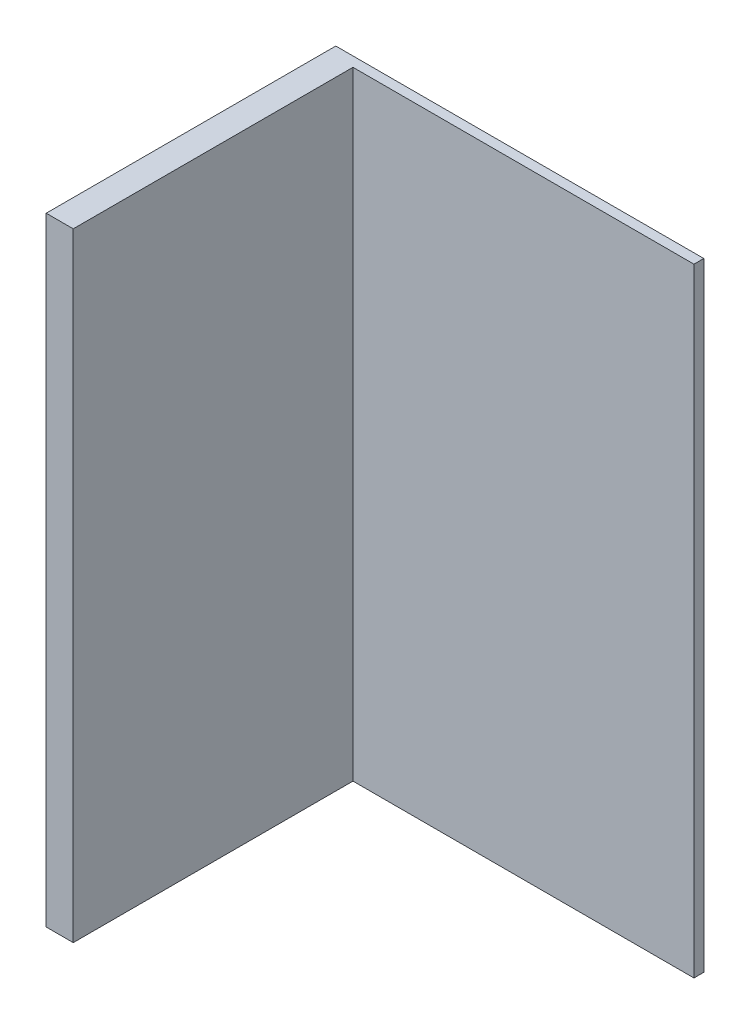
ISO-10303-21;
HEADER;
FILE_DESCRIPTION(('STEP AP214'),'2;1');
FILE_NAME('part.step','',(''),(''),'','','');
FILE_SCHEMA(('AUTOMOTIVE_DESIGN { 1 0 10303 214 1 1 1 1 }'));
ENDSEC;
DATA;
#1=APPLICATION_CONTEXT('core data for automotive mechanical design processes');
#2=APPLICATION_PROTOCOL_DEFINITION('international standard','automotive_design',2000,#1);
#3=PRODUCT_CONTEXT('',#1,'mechanical');
#4=PRODUCT('Part','Part','',(#3));
#5=PRODUCT_RELATED_PRODUCT_CATEGORY('part','',(#4));
#6=PRODUCT_DEFINITION_FORMATION('','',#4);
#7=PRODUCT_DEFINITION_CONTEXT('part definition',#1,'design');
#8=PRODUCT_DEFINITION('design','',#6,#7);
#9=PRODUCT_DEFINITION_SHAPE('','',#8);
#10=(LENGTH_UNIT() NAMED_UNIT(*) SI_UNIT(.MILLI.,.METRE.));
#11=(NAMED_UNIT(*) PLANE_ANGLE_UNIT() SI_UNIT($,.RADIAN.));
#12=(NAMED_UNIT(*) SI_UNIT($,.STERADIAN.) SOLID_ANGLE_UNIT());
#13=UNCERTAINTY_MEASURE_WITH_UNIT(LENGTH_MEASURE(1.E-05),#10,'distance_accuracy_value','');
#14=(GEOMETRIC_REPRESENTATION_CONTEXT(3) GLOBAL_UNCERTAINTY_ASSIGNED_CONTEXT((#13)) GLOBAL_UNIT_ASSIGNED_CONTEXT((#10,
#11,#12)) REPRESENTATION_CONTEXT('',''));
#15=CARTESIAN_POINT('',(0.,0.,0.));
#16=DIRECTION('',(0.,0.,1.));
#17=DIRECTION('',(1.,0.,0.));
#18=AXIS2_PLACEMENT_3D('',#15,#16,#17);
#19=CARTESIAN_POINT('',(-3.696,-1.6,0.));
#20=DIRECTION('',(0.,-1.,0.));
#21=DIRECTION('',(0.,0.,1.));
#22=AXIS2_PLACEMENT_3D('',#19,#20,#21);
#23=PLANE('',#22);
#24=DIRECTION('',(-1.,0.,0.));
#25=VECTOR('',#24,1.);
#26=CARTESIAN_POINT('',(-1.791,-1.6,0.));
#27=LINE('',#26,#25);
#28=CARTESIAN_POINT('',(-1.791,-1.6,0.));
#29=VERTEX_POINT('',#28);
#30=CARTESIAN_POINT('',(-3.696,-1.6,0.));
#31=VERTEX_POINT('',#30);
#32=EDGE_CURVE('E11',#29,#31,#27,.T.);
#33=ORIENTED_EDGE('',*,*,#32,.F.);
#34=DIRECTION('',(0.,0.,-1.));
#35=VECTOR('',#34,1.);
#36=CARTESIAN_POINT('',(-1.791,-1.6,0.051));
#37=LINE('',#36,#35);
#38=CARTESIAN_POINT('',(-1.791,-1.6,0.051));
#39=VERTEX_POINT('',#38);
#40=EDGE_CURVE('E24',#39,#29,#37,.T.);
#41=ORIENTED_EDGE('',*,*,#40,.F.);
#42=DIRECTION('',(1.,0.,0.));
#43=VECTOR('',#42,1.);
#44=CARTESIAN_POINT('',(-3.556,-1.6,0.051));
#45=LINE('',#44,#43);
#46=CARTESIAN_POINT('',(-3.556,-1.6,0.051));
#47=VERTEX_POINT('',#46);
#48=EDGE_CURVE('E87',#47,#39,#45,.T.);
#49=ORIENTED_EDGE('',*,*,#48,.F.);
#50=DIRECTION('',(0.,0.,-1.));
#51=VECTOR('',#50,1.);
#52=CARTESIAN_POINT('',(-3.556,-1.6,1.499));
#53=LINE('',#52,#51);
#54=CARTESIAN_POINT('',(-3.556,-1.6,1.499));
#55=VERTEX_POINT('',#54);
#56=EDGE_CURVE('E114',#55,#47,#53,.T.);
#57=ORIENTED_EDGE('',*,*,#56,.F.);
#58=DIRECTION('',(1.,0.,0.));
#59=VECTOR('',#58,1.);
#60=CARTESIAN_POINT('',(-3.696,-1.6,1.499));
#61=LINE('',#60,#59);
#62=CARTESIAN_POINT('',(-3.696,-1.6,1.499));
#63=VERTEX_POINT('',#62);
#64=EDGE_CURVE('E111',#63,#55,#61,.T.);
#65=ORIENTED_EDGE('',*,*,#64,.F.);
#66=DIRECTION('',(0.,0.,1.));
#67=VECTOR('',#66,1.);
#68=CARTESIAN_POINT('',(-3.696,-1.6,0.));
#69=LINE('',#68,#67);
#70=EDGE_CURVE('E108',#31,#63,#69,.T.);
#71=ORIENTED_EDGE('',*,*,#70,.F.);
#72=EDGE_LOOP('',(#33,#41,#49,#57,#65,#71));
#73=FACE_BOUND('',#72,.T.);
#74=ADVANCED_FACE('F17',(#73),#23,.T.);
#75=CARTESIAN_POINT('',(-1.791,1.6,0.));
#76=DIRECTION('',(0.,1.,0.));
#77=DIRECTION('',(0.,0.,1.));
#78=AXIS2_PLACEMENT_3D('',#75,#76,#77);
#79=PLANE('',#78);
#80=DIRECTION('',(1.,0.,0.));
#81=VECTOR('',#80,1.);
#82=CARTESIAN_POINT('',(-3.696,1.6,0.));
#83=LINE('',#82,#81);
#84=CARTESIAN_POINT('',(-3.696,1.6,0.));
#85=VERTEX_POINT('',#84);
#86=CARTESIAN_POINT('',(-1.791,1.6,0.));
#87=VERTEX_POINT('',#86);
#88=EDGE_CURVE('E106',#85,#87,#83,.T.);
#89=ORIENTED_EDGE('',*,*,#88,.F.);
#90=DIRECTION('',(0.,0.,-1.));
#91=VECTOR('',#90,1.);
#92=CARTESIAN_POINT('',(-3.696,1.6,1.499));
#93=LINE('',#92,#91);
#94=CARTESIAN_POINT('',(-3.696,1.6,1.499));
#95=VERTEX_POINT('',#94);
#96=EDGE_CURVE('E103',#95,#85,#93,.T.);
#97=ORIENTED_EDGE('',*,*,#96,.F.);
#98=DIRECTION('',(-1.,0.,0.));
#99=VECTOR('',#98,1.);
#100=CARTESIAN_POINT('',(-3.556,1.6,1.499));
#101=LINE('',#100,#99);
#102=CARTESIAN_POINT('',(-3.556,1.6,1.499));
#103=VERTEX_POINT('',#102);
#104=EDGE_CURVE('E100',#103,#95,#101,.T.);
#105=ORIENTED_EDGE('',*,*,#104,.F.);
#106=DIRECTION('',(0.,0.,1.));
#107=VECTOR('',#106,1.);
#108=CARTESIAN_POINT('',(-3.556,1.6,0.051));
#109=LINE('',#108,#107);
#110=CARTESIAN_POINT('',(-3.556,1.6,0.051));
#111=VERTEX_POINT('',#110);
#112=EDGE_CURVE('E72',#111,#103,#109,.T.);
#113=ORIENTED_EDGE('',*,*,#112,.F.);
#114=DIRECTION('',(-1.,0.,0.));
#115=VECTOR('',#114,1.);
#116=CARTESIAN_POINT('',(-1.791,1.6,0.051));
#117=LINE('',#116,#115);
#118=CARTESIAN_POINT('',(-1.791,1.6,0.051));
#119=VERTEX_POINT('',#118);
#120=EDGE_CURVE('E66',#119,#111,#117,.T.);
#121=ORIENTED_EDGE('',*,*,#120,.F.);
#122=DIRECTION('',(0.,0.,1.));
#123=VECTOR('',#122,1.);
#124=CARTESIAN_POINT('',(-1.791,1.6,0.));
#125=LINE('',#124,#123);
#126=EDGE_CURVE('E69',#87,#119,#125,.T.);
#127=ORIENTED_EDGE('',*,*,#126,.F.);
#128=EDGE_LOOP('',(#89,#97,#105,#113,#121,#127));
#129=FACE_BOUND('',#128,.T.);
#130=ADVANCED_FACE('F68',(#129),#79,.T.);
#131=CARTESIAN_POINT('',(-3.696,-1.6,1.499));
#132=DIRECTION('',(0.,0.,1.));
#133=DIRECTION('',(0.,1.,0.));
#134=AXIS2_PLACEMENT_3D('',#131,#132,#133);
#135=PLANE('',#134);
#136=ORIENTED_EDGE('',*,*,#64,.T.);
#137=DIRECTION('',(0.,-1.,0.));
#138=VECTOR('',#137,1.);
#139=CARTESIAN_POINT('',(-3.556,1.6,1.499));
#140=LINE('',#139,#138);
#141=EDGE_CURVE('E83',#103,#55,#140,.T.);
#142=ORIENTED_EDGE('',*,*,#141,.F.);
#143=ORIENTED_EDGE('',*,*,#104,.T.);
#144=DIRECTION('',(0.,1.,0.));
#145=VECTOR('',#144,1.);
#146=CARTESIAN_POINT('',(-3.696,-1.6,1.499));
#147=LINE('',#146,#145);
#148=EDGE_CURVE('E88',#63,#95,#147,.T.);
#149=ORIENTED_EDGE('',*,*,#148,.F.);
#150=EDGE_LOOP('',(#136,#142,#143,#149));
#151=FACE_BOUND('',#150,.T.);
#152=ADVANCED_FACE('F125',(#151),#135,.T.);
#153=CARTESIAN_POINT('',(-3.556,-1.6,0.051));
#154=DIRECTION('',(0.,0.,1.));
#155=DIRECTION('',(0.,1.,0.));
#156=AXIS2_PLACEMENT_3D('',#153,#154,#155);
#157=PLANE('',#156);
#158=ORIENTED_EDGE('',*,*,#48,.T.);
#159=DIRECTION('',(0.,-1.,0.));
#160=VECTOR('',#159,1.);
#161=CARTESIAN_POINT('',(-1.791,1.6,0.051));
#162=LINE('',#161,#160);
#163=EDGE_CURVE('E81',#119,#39,#162,.T.);
#164=ORIENTED_EDGE('',*,*,#163,.F.);
#165=ORIENTED_EDGE('',*,*,#120,.T.);
#166=DIRECTION('',(0.,1.,0.));
#167=VECTOR('',#166,1.);
#168=CARTESIAN_POINT('',(-3.556,-1.6,0.051));
#169=LINE('',#168,#167);
#170=EDGE_CURVE('E89',#47,#111,#169,.T.);
#171=ORIENTED_EDGE('',*,*,#170,.F.);
#172=EDGE_LOOP('',(#158,#164,#165,#171));
#173=FACE_BOUND('',#172,.T.);
#174=ADVANCED_FACE('F86',(#173),#157,.T.);
#175=CARTESIAN_POINT('',(-3.696,1.6,0.));
#176=DIRECTION('',(-1.,0.,0.));
#177=DIRECTION('',(0.,0.,1.));
#178=AXIS2_PLACEMENT_3D('',#175,#176,#177);
#179=PLANE('',#178);
#180=DIRECTION('',(0.,1.,0.));
#181=VECTOR('',#180,1.);
#182=CARTESIAN_POINT('',(-3.696,-1.6,0.));
#183=LINE('',#182,#181);
#184=EDGE_CURVE('E93',#31,#85,#183,.T.);
#185=ORIENTED_EDGE('',*,*,#184,.F.);
#186=ORIENTED_EDGE('',*,*,#70,.T.);
#187=ORIENTED_EDGE('',*,*,#148,.T.);
#188=ORIENTED_EDGE('',*,*,#96,.T.);
#189=EDGE_LOOP('',(#185,#186,#187,#188));
#190=FACE_BOUND('',#189,.T.);
#191=ADVANCED_FACE('F121',(#190),#179,.T.);
#192=CARTESIAN_POINT('',(-1.791,-1.6,0.));
#193=DIRECTION('',(1.,0.,0.));
#194=DIRECTION('',(0.,0.,1.));
#195=AXIS2_PLACEMENT_3D('',#192,#193,#194);
#196=PLANE('',#195);
#197=DIRECTION('',(0.,-1.,0.));
#198=VECTOR('',#197,1.);
#199=CARTESIAN_POINT('',(-1.791,1.6,0.));
#200=LINE('',#199,#198);
#201=EDGE_CURVE('E82',#87,#29,#200,.T.);
#202=ORIENTED_EDGE('',*,*,#201,.F.);
#203=ORIENTED_EDGE('',*,*,#126,.T.);
#204=ORIENTED_EDGE('',*,*,#163,.T.);
#205=ORIENTED_EDGE('',*,*,#40,.T.);
#206=EDGE_LOOP('',(#202,#203,#204,#205));
#207=FACE_BOUND('',#206,.T.);
#208=ADVANCED_FACE('F80',(#207),#196,.T.);
#209=CARTESIAN_POINT('',(-3.556,-1.6,0.051));
#210=DIRECTION('',(1.,0.,0.));
#211=DIRECTION('',(0.,0.,1.));
#212=AXIS2_PLACEMENT_3D('',#209,#210,#211);
#213=PLANE('',#212);
#214=ORIENTED_EDGE('',*,*,#170,.T.);
#215=ORIENTED_EDGE('',*,*,#112,.T.);
#216=ORIENTED_EDGE('',*,*,#141,.T.);
#217=ORIENTED_EDGE('',*,*,#56,.T.);
#218=EDGE_LOOP('',(#214,#215,#216,#217));
#219=FACE_BOUND('',#218,.T.);
#220=ADVANCED_FACE('F127',(#219),#213,.T.);
#221=CARTESIAN_POINT('',(-3.696,1.6,0.));
#222=DIRECTION('',(0.,0.,-1.));
#223=DIRECTION('',(0.,1.,0.));
#224=AXIS2_PLACEMENT_3D('',#221,#222,#223);
#225=PLANE('',#224);
#226=ORIENTED_EDGE('',*,*,#88,.T.);
#227=ORIENTED_EDGE('',*,*,#201,.T.);
#228=ORIENTED_EDGE('',*,*,#32,.T.);
#229=ORIENTED_EDGE('',*,*,#184,.T.);
#230=EDGE_LOOP('',(#226,#227,#228,#229));
#231=FACE_BOUND('',#230,.T.);
#232=ADVANCED_FACE('F117',(#231),#225,.T.);
#233=CLOSED_SHELL('',(#74,#130,#152,#174,#191,#208,#220,#232));
#234=MANIFOLD_SOLID_BREP('B1',#233);
#235=ADVANCED_BREP_SHAPE_REPRESENTATION('',(#18,#234),#14);
#236=SHAPE_DEFINITION_REPRESENTATION(#9,#235);
ENDSEC;
END-ISO-10303-21;
